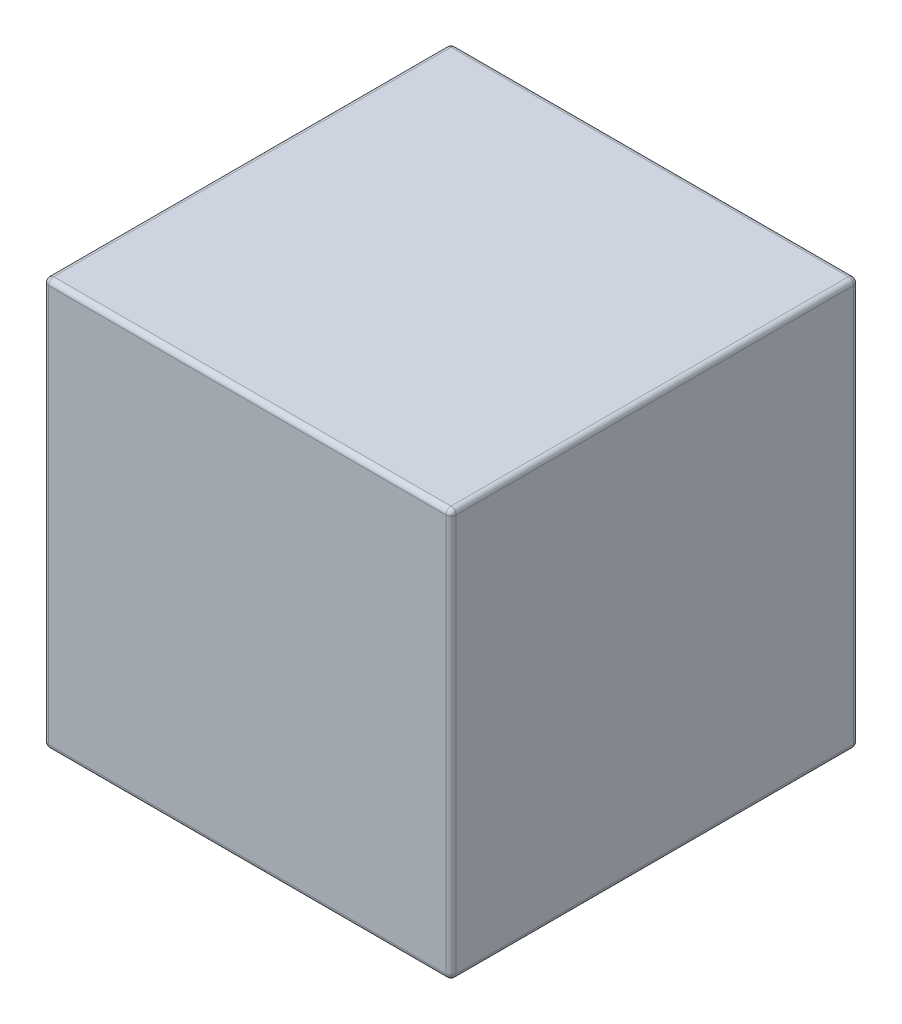
ISO-10303-21;
HEADER;
FILE_DESCRIPTION(('STEP AP214'),'2;1');
FILE_NAME('part.step','',(''),(''),'','','');
FILE_SCHEMA(('AUTOMOTIVE_DESIGN { 1 0 10303 214 1 1 1 1 }'));
ENDSEC;
DATA;
#1=APPLICATION_CONTEXT('core data for automotive mechanical design processes');
#2=APPLICATION_PROTOCOL_DEFINITION('international standard','automotive_design',2000,#1);
#3=PRODUCT_CONTEXT('',#1,'mechanical');
#4=PRODUCT('Part','Part','',(#3));
#5=PRODUCT_RELATED_PRODUCT_CATEGORY('part','',(#4));
#6=PRODUCT_DEFINITION_FORMATION('','',#4);
#7=PRODUCT_DEFINITION_CONTEXT('part definition',#1,'design');
#8=PRODUCT_DEFINITION('design','',#6,#7);
#9=PRODUCT_DEFINITION_SHAPE('','',#8);
#10=(LENGTH_UNIT() NAMED_UNIT(*) SI_UNIT(.MILLI.,.METRE.));
#11=(NAMED_UNIT(*) PLANE_ANGLE_UNIT() SI_UNIT($,.RADIAN.));
#12=(NAMED_UNIT(*) SI_UNIT($,.STERADIAN.) SOLID_ANGLE_UNIT());
#13=UNCERTAINTY_MEASURE_WITH_UNIT(LENGTH_MEASURE(1.E-05),#10,'distance_accuracy_value','');
#14=(GEOMETRIC_REPRESENTATION_CONTEXT(3) GLOBAL_UNCERTAINTY_ASSIGNED_CONTEXT((#13)) GLOBAL_UNIT_ASSIGNED_CONTEXT((#10,
#11,#12)) REPRESENTATION_CONTEXT('',''));
#15=CARTESIAN_POINT('',(0.,0.,0.));
#16=DIRECTION('',(0.,0.,1.));
#17=DIRECTION('',(1.,0.,0.));
#18=AXIS2_PLACEMENT_3D('',#15,#16,#17);
#19=CARTESIAN_POINT('',(25.4,50.8,25.4));
#20=DIRECTION('',(-1.,0.,0.));
#21=DIRECTION('',(0.,0.,1.));
#22=AXIS2_PLACEMENT_3D('',#19,#20,#21);
#23=PLANE('',#22);
#24=DIRECTION('',(0.,0.,-1.));
#25=VECTOR('',#24,1.);
#26=CARTESIAN_POINT('',(25.4,0.634999999999997,-25.4));
#27=LINE('',#26,#25);
#28=CARTESIAN_POINT('',(25.4,0.634999999999997,24.765));
#29=VERTEX_POINT('',#28);
#30=CARTESIAN_POINT('',(25.4,0.634999999999997,-24.765));
#31=VERTEX_POINT('',#30);
#32=EDGE_CURVE('E337',#29,#31,#27,.T.);
#33=ORIENTED_EDGE('',*,*,#32,.T.);
#34=DIRECTION('',(0.,-1.,0.));
#35=VECTOR('',#34,1.);
#36=CARTESIAN_POINT('',(25.4,50.8,-24.765));
#37=LINE('',#36,#35);
#38=CARTESIAN_POINT('',(25.4,50.165,-24.765));
#39=VERTEX_POINT('',#38);
#40=EDGE_CURVE('E257',#31,#39,#37,.F.);
#41=ORIENTED_EDGE('',*,*,#40,.T.);
#42=DIRECTION('',(0.,0.,-1.));
#43=VECTOR('',#42,1.);
#44=CARTESIAN_POINT('',(25.4,50.165,25.4));
#45=LINE('',#44,#43);
#46=CARTESIAN_POINT('',(25.4,50.165,24.765));
#47=VERTEX_POINT('',#46);
#48=EDGE_CURVE('E244',#39,#47,#45,.F.);
#49=ORIENTED_EDGE('',*,*,#48,.T.);
#50=DIRECTION('',(0.,-1.,0.));
#51=VECTOR('',#50,1.);
#52=CARTESIAN_POINT('',(25.4,50.8,24.765));
#53=LINE('',#52,#51);
#54=EDGE_CURVE('E332',#47,#29,#53,.T.);
#55=ORIENTED_EDGE('',*,*,#54,.T.);
#56=EDGE_LOOP('',(#33,#41,#49,#55));
#57=FACE_BOUND('',#56,.T.);
#58=ADVANCED_FACE('F46',(#57),#23,.F.);
#59=CARTESIAN_POINT('',(-25.4,50.8,-25.4));
#60=DIRECTION('',(0.,0.,1.));
#61=DIRECTION('',(1.,0.,0.));
#62=AXIS2_PLACEMENT_3D('',#59,#60,#61);
#63=PLANE('',#62);
#64=DIRECTION('',(-1.,0.,0.));
#65=VECTOR('',#64,1.);
#66=CARTESIAN_POINT('',(-25.4,0.634999999999997,-25.4));
#67=LINE('',#66,#65);
#68=CARTESIAN_POINT('',(24.765,0.634999999999997,-25.4));
#69=VERTEX_POINT('',#68);
#70=CARTESIAN_POINT('',(-24.765,0.634999999999997,-25.4));
#71=VERTEX_POINT('',#70);
#72=EDGE_CURVE('E310',#69,#71,#67,.T.);
#73=ORIENTED_EDGE('',*,*,#72,.T.);
#74=DIRECTION('',(0.,-1.,0.));
#75=VECTOR('',#74,1.);
#76=CARTESIAN_POINT('',(-24.765,50.8,-25.4));
#77=LINE('',#76,#75);
#78=CARTESIAN_POINT('',(-24.765,50.165,-25.4));
#79=VERTEX_POINT('',#78);
#80=EDGE_CURVE('E307',#71,#79,#77,.F.);
#81=ORIENTED_EDGE('',*,*,#80,.T.);
#82=DIRECTION('',(-1.,0.,0.));
#83=VECTOR('',#82,1.);
#84=CARTESIAN_POINT('',(-25.4,50.165,-25.4));
#85=LINE('',#84,#83);
#86=CARTESIAN_POINT('',(24.765,50.165,-25.4));
#87=VERTEX_POINT('',#86);
#88=EDGE_CURVE('E298',#79,#87,#85,.F.);
#89=ORIENTED_EDGE('',*,*,#88,.T.);
#90=DIRECTION('',(0.,-1.,0.));
#91=VECTOR('',#90,1.);
#92=CARTESIAN_POINT('',(24.765,50.8,-25.4));
#93=LINE('',#92,#91);
#94=EDGE_CURVE('E304',#87,#69,#93,.T.);
#95=ORIENTED_EDGE('',*,*,#94,.T.);
#96=EDGE_LOOP('',(#73,#81,#89,#95));
#97=FACE_BOUND('',#96,.T.);
#98=ADVANCED_FACE('F308',(#97),#63,.F.);
#99=CARTESIAN_POINT('',(-25.4,50.8,25.4));
#100=DIRECTION('',(1.,0.,0.));
#101=DIRECTION('',(0.,0.,-1.));
#102=AXIS2_PLACEMENT_3D('',#99,#100,#101);
#103=PLANE('',#102);
#104=DIRECTION('',(0.,0.,1.));
#105=VECTOR('',#104,1.);
#106=CARTESIAN_POINT('',(-25.4,50.165,25.4));
#107=LINE('',#106,#105);
#108=CARTESIAN_POINT('',(-25.4,50.165,24.765));
#109=VERTEX_POINT('',#108);
#110=CARTESIAN_POINT('',(-25.4,50.165,-24.765));
#111=VERTEX_POINT('',#110);
#112=EDGE_CURVE('E147',#109,#111,#107,.F.);
#113=ORIENTED_EDGE('',*,*,#112,.T.);
#114=DIRECTION('',(0.,-1.,0.));
#115=VECTOR('',#114,1.);
#116=CARTESIAN_POINT('',(-25.4,50.8,-24.765));
#117=LINE('',#116,#115);
#118=CARTESIAN_POINT('',(-25.4,0.634999999999997,-24.765));
#119=VERTEX_POINT('',#118);
#120=EDGE_CURVE('E142',#111,#119,#117,.T.);
#121=ORIENTED_EDGE('',*,*,#120,.T.);
#122=DIRECTION('',(0.,0.,1.));
#123=VECTOR('',#122,1.);
#124=CARTESIAN_POINT('',(-25.4,0.634999999999997,25.4));
#125=LINE('',#124,#123);
#126=CARTESIAN_POINT('',(-25.4,0.634999999999997,24.765));
#127=VERTEX_POINT('',#126);
#128=EDGE_CURVE('E136',#119,#127,#125,.T.);
#129=ORIENTED_EDGE('',*,*,#128,.T.);
#130=DIRECTION('',(0.,-1.,0.));
#131=VECTOR('',#130,1.);
#132=CARTESIAN_POINT('',(-25.4,50.8,24.765));
#133=LINE('',#132,#131);
#134=EDGE_CURVE('E139',#127,#109,#133,.F.);
#135=ORIENTED_EDGE('',*,*,#134,.T.);
#136=EDGE_LOOP('',(#113,#121,#129,#135));
#137=FACE_BOUND('',#136,.T.);
#138=ADVANCED_FACE('F138',(#137),#103,.F.);
#139=CARTESIAN_POINT('',(-25.4,50.8,25.4));
#140=DIRECTION('',(0.,0.,-1.));
#141=DIRECTION('',(-1.,0.,0.));
#142=AXIS2_PLACEMENT_3D('',#139,#140,#141);
#143=PLANE('',#142);
#144=DIRECTION('',(1.,0.,0.));
#145=VECTOR('',#144,1.);
#146=CARTESIAN_POINT('',(-25.4,50.165,25.4));
#147=LINE('',#146,#145);
#148=CARTESIAN_POINT('',(24.765,50.165,25.4));
#149=VERTEX_POINT('',#148);
#150=CARTESIAN_POINT('',(-24.765,50.165,25.4));
#151=VERTEX_POINT('',#150);
#152=EDGE_CURVE('E56',#149,#151,#147,.F.);
#153=ORIENTED_EDGE('',*,*,#152,.T.);
#154=DIRECTION('',(0.,-1.,0.));
#155=VECTOR('',#154,1.);
#156=CARTESIAN_POINT('',(-24.765,50.8,25.4));
#157=LINE('',#156,#155);
#158=CARTESIAN_POINT('',(-24.765,0.634999999999997,25.4));
#159=VERTEX_POINT('',#158);
#160=EDGE_CURVE('E11',#151,#159,#157,.T.);
#161=ORIENTED_EDGE('',*,*,#160,.T.);
#162=DIRECTION('',(1.,0.,0.));
#163=VECTOR('',#162,1.);
#164=CARTESIAN_POINT('',(25.4,0.634999999999997,25.4));
#165=LINE('',#164,#163);
#166=CARTESIAN_POINT('',(24.765,0.634999999999997,25.4));
#167=VERTEX_POINT('',#166);
#168=EDGE_CURVE('E264',#159,#167,#165,.T.);
#169=ORIENTED_EDGE('',*,*,#168,.T.);
#170=DIRECTION('',(0.,-1.,0.));
#171=VECTOR('',#170,1.);
#172=CARTESIAN_POINT('',(24.765,50.8,25.4));
#173=LINE('',#172,#171);
#174=EDGE_CURVE('E67',#167,#149,#173,.F.);
#175=ORIENTED_EDGE('',*,*,#174,.T.);
#176=EDGE_LOOP('',(#153,#161,#169,#175));
#177=FACE_BOUND('',#176,.T.);
#178=ADVANCED_FACE('F442',(#177),#143,.F.);
#179=CARTESIAN_POINT('',(0.,50.8,0.));
#180=DIRECTION('',(0.,-1.,0.));
#181=DIRECTION('',(0.,0.,-1.));
#182=AXIS2_PLACEMENT_3D('',#179,#180,#181);
#183=PLANE('',#182);
#184=DIRECTION('',(-1.,0.,0.));
#185=VECTOR('',#184,1.);
#186=CARTESIAN_POINT('',(0.,50.8,-24.765));
#187=LINE('',#186,#185);
#188=CARTESIAN_POINT('',(24.765,50.8,-24.765));
#189=VERTEX_POINT('',#188);
#190=CARTESIAN_POINT('',(-24.765,50.8,-24.765));
#191=VERTEX_POINT('',#190);
#192=EDGE_CURVE('E250',#189,#191,#187,.T.);
#193=ORIENTED_EDGE('',*,*,#192,.T.);
#194=DIRECTION('',(0.,0.,1.));
#195=VECTOR('',#194,1.);
#196=CARTESIAN_POINT('',(-24.765,50.8,0.));
#197=LINE('',#196,#195);
#198=CARTESIAN_POINT('',(-24.765,50.8,24.765));
#199=VERTEX_POINT('',#198);
#200=EDGE_CURVE('E255',#191,#199,#197,.T.);
#201=ORIENTED_EDGE('',*,*,#200,.T.);
#202=DIRECTION('',(1.,0.,0.));
#203=VECTOR('',#202,1.);
#204=CARTESIAN_POINT('',(0.,50.8,24.765));
#205=LINE('',#204,#203);
#206=CARTESIAN_POINT('',(24.765,50.8,24.765));
#207=VERTEX_POINT('',#206);
#208=EDGE_CURVE('E251',#199,#207,#205,.T.);
#209=ORIENTED_EDGE('',*,*,#208,.T.);
#210=DIRECTION('',(0.,0.,-1.));
#211=VECTOR('',#210,1.);
#212=CARTESIAN_POINT('',(24.765,50.8,0.));
#213=LINE('',#212,#211);
#214=EDGE_CURVE('E246',#207,#189,#213,.T.);
#215=ORIENTED_EDGE('',*,*,#214,.T.);
#216=EDGE_LOOP('',(#193,#201,#209,#215));
#217=FACE_BOUND('',#216,.T.);
#218=ADVANCED_FACE('F367',(#217),#183,.F.);
#219=CARTESIAN_POINT('',(0.,0.,0.));
#220=DIRECTION('',(0.,-1.,0.));
#221=DIRECTION('',(0.,0.,-1.));
#222=AXIS2_PLACEMENT_3D('',#219,#220,#221);
#223=PLANE('',#222);
#224=DIRECTION('',(0.,0.,1.));
#225=VECTOR('',#224,1.);
#226=CARTESIAN_POINT('',(-24.765,0.,-25.4));
#227=LINE('',#226,#225);
#228=CARTESIAN_POINT('',(-24.765,0.,24.765));
#229=VERTEX_POINT('',#228);
#230=CARTESIAN_POINT('',(-24.765,0.,-24.765));
#231=VERTEX_POINT('',#230);
#232=EDGE_CURVE('E170',#229,#231,#227,.F.);
#233=ORIENTED_EDGE('',*,*,#232,.T.);
#234=DIRECTION('',(-1.,0.,0.));
#235=VECTOR('',#234,1.);
#236=CARTESIAN_POINT('',(25.4,0.,-24.765));
#237=LINE('',#236,#235);
#238=CARTESIAN_POINT('',(24.765,0.,-24.765));
#239=VERTEX_POINT('',#238);
#240=EDGE_CURVE('E328',#231,#239,#237,.F.);
#241=ORIENTED_EDGE('',*,*,#240,.T.);
#242=DIRECTION('',(0.,0.,-1.));
#243=VECTOR('',#242,1.);
#244=CARTESIAN_POINT('',(24.765,0.,25.4));
#245=LINE('',#244,#243);
#246=CARTESIAN_POINT('',(24.765,0.,24.765));
#247=VERTEX_POINT('',#246);
#248=EDGE_CURVE('E319',#239,#247,#245,.F.);
#249=ORIENTED_EDGE('',*,*,#248,.T.);
#250=DIRECTION('',(1.,0.,0.));
#251=VECTOR('',#250,1.);
#252=CARTESIAN_POINT('',(-25.4,0.,24.765));
#253=LINE('',#252,#251);
#254=EDGE_CURVE('E315',#247,#229,#253,.F.);
#255=ORIENTED_EDGE('',*,*,#254,.T.);
#256=EDGE_LOOP('',(#233,#241,#249,#255));
#257=FACE_BOUND('',#256,.T.);
#258=ADVANCED_FACE('F433',(#257),#223,.T.);
#259=CARTESIAN_POINT('',(24.765,50.8,24.765));
#260=DIRECTION('',(0.,-1.,0.));
#261=DIRECTION('',(0.,0.,-1.));
#262=AXIS2_PLACEMENT_3D('',#259,#260,#261);
#263=CYLINDRICAL_SURFACE('',#262,0.635);
#264=CARTESIAN_POINT('',(24.765,50.165,24.765));
#265=DIRECTION('',(0.,1.,0.));
#266=DIRECTION('',(0.,0.,1.));
#267=AXIS2_PLACEMENT_3D('',#264,#265,#266);
#268=CIRCLE('',#267,0.635);
#269=EDGE_CURVE('E50',#149,#47,#268,.T.);
#270=ORIENTED_EDGE('',*,*,#269,.F.);
#271=ORIENTED_EDGE('',*,*,#174,.F.);
#272=CARTESIAN_POINT('',(24.765,0.634999999999997,24.765));
#273=DIRECTION('',(0.,-1.,0.));
#274=DIRECTION('',(0.,0.,-1.));
#275=AXIS2_PLACEMENT_3D('',#272,#273,#274);
#276=CIRCLE('',#275,0.635);
#277=EDGE_CURVE('E224',#29,#167,#276,.T.);
#278=ORIENTED_EDGE('',*,*,#277,.F.);
#279=ORIENTED_EDGE('',*,*,#54,.F.);
#280=EDGE_LOOP('',(#270,#271,#278,#279));
#281=FACE_BOUND('',#280,.T.);
#282=ADVANCED_FACE('F48',(#281),#263,.T.);
#283=CARTESIAN_POINT('',(24.765,50.165,24.765));
#284=DIRECTION('',(1.,0.,0.));
#285=DIRECTION('',(0.,0.,-1.));
#286=AXIS2_PLACEMENT_3D('',#283,#284,#285);
#287=SPHERICAL_SURFACE('',#286,0.635);
#288=CARTESIAN_POINT('',(24.765,50.165,24.765));
#289=DIRECTION('',(1.,0.,0.));
#290=DIRECTION('',(0.,0.,-1.));
#291=AXIS2_PLACEMENT_3D('',#288,#289,#290);
#292=CIRCLE('',#291,0.635);
#293=EDGE_CURVE('E217',#149,#207,#292,.F.);
#294=ORIENTED_EDGE('',*,*,#293,.F.);
#295=ORIENTED_EDGE('',*,*,#269,.T.);
#296=CARTESIAN_POINT('',(24.765,50.165,24.765));
#297=DIRECTION('',(0.,0.,1.));
#298=DIRECTION('',(1.,0.,0.));
#299=AXIS2_PLACEMENT_3D('',#296,#297,#298);
#300=CIRCLE('',#299,0.635);
#301=EDGE_CURVE('E221',#207,#47,#300,.F.);
#302=ORIENTED_EDGE('',*,*,#301,.F.);
#303=EDGE_LOOP('',(#294,#295,#302));
#304=FACE_BOUND('',#303,.T.);
#305=ADVANCED_FACE('F236',(#304),#287,.T.);
#306=CARTESIAN_POINT('',(24.765,0.635,24.765));
#307=DIRECTION('',(0.,0.,1.));
#308=DIRECTION('',(0.,-1.,0.));
#309=AXIS2_PLACEMENT_3D('',#306,#307,#308);
#310=SPHERICAL_SURFACE('',#309,0.635);
#311=CARTESIAN_POINT('',(24.765,0.635,24.765));
#312=DIRECTION('',(0.,0.,1.));
#313=DIRECTION('',(1.,0.,0.));
#314=AXIS2_PLACEMENT_3D('',#311,#312,#313);
#315=CIRCLE('',#314,0.635);
#316=EDGE_CURVE('E209',#29,#247,#315,.F.);
#317=ORIENTED_EDGE('',*,*,#316,.F.);
#318=ORIENTED_EDGE('',*,*,#277,.T.);
#319=CARTESIAN_POINT('',(24.765,0.634999999999997,24.765));
#320=DIRECTION('',(1.,0.,0.));
#321=DIRECTION('',(0.,0.,-1.));
#322=AXIS2_PLACEMENT_3D('',#319,#320,#321);
#323=CIRCLE('',#322,0.635);
#324=EDGE_CURVE('E213',#247,#167,#323,.F.);
#325=ORIENTED_EDGE('',*,*,#324,.F.);
#326=EDGE_LOOP('',(#317,#318,#325));
#327=FACE_BOUND('',#326,.T.);
#328=ADVANCED_FACE('F385',(#327),#310,.T.);
#329=CARTESIAN_POINT('',(24.765,50.165,0.));
#330=DIRECTION('',(0.,0.,-1.));
#331=DIRECTION('',(-1.,0.,0.));
#332=AXIS2_PLACEMENT_3D('',#329,#330,#331);
#333=CYLINDRICAL_SURFACE('',#332,0.635);
#334=ORIENTED_EDGE('',*,*,#301,.T.);
#335=ORIENTED_EDGE('',*,*,#48,.F.);
#336=CARTESIAN_POINT('',(24.765,50.165,-24.765));
#337=DIRECTION('',(0.,0.,-1.));
#338=DIRECTION('',(-1.,0.,0.));
#339=AXIS2_PLACEMENT_3D('',#336,#337,#338);
#340=CIRCLE('',#339,0.635);
#341=EDGE_CURVE('E202',#189,#39,#340,.T.);
#342=ORIENTED_EDGE('',*,*,#341,.F.);
#343=ORIENTED_EDGE('',*,*,#214,.F.);
#344=EDGE_LOOP('',(#334,#335,#342,#343));
#345=FACE_BOUND('',#344,.T.);
#346=ADVANCED_FACE('F242',(#345),#333,.T.);
#347=CARTESIAN_POINT('',(0.,50.165,24.765));
#348=DIRECTION('',(1.,0.,0.));
#349=DIRECTION('',(0.,0.,-1.));
#350=AXIS2_PLACEMENT_3D('',#347,#348,#349);
#351=CYLINDRICAL_SURFACE('',#350,0.635);
#352=ORIENTED_EDGE('',*,*,#293,.T.);
#353=ORIENTED_EDGE('',*,*,#208,.F.);
#354=CARTESIAN_POINT('',(-24.765,50.165,24.765));
#355=DIRECTION('',(-1.,0.,0.));
#356=DIRECTION('',(0.,0.,1.));
#357=AXIS2_PLACEMENT_3D('',#354,#355,#356);
#358=CIRCLE('',#357,0.635);
#359=EDGE_CURVE('E198',#151,#199,#358,.T.);
#360=ORIENTED_EDGE('',*,*,#359,.F.);
#361=ORIENTED_EDGE('',*,*,#152,.F.);
#362=EDGE_LOOP('',(#352,#353,#360,#361));
#363=FACE_BOUND('',#362,.T.);
#364=ADVANCED_FACE('F376',(#363),#351,.T.);
#365=CARTESIAN_POINT('',(-24.765,50.8,24.765));
#366=DIRECTION('',(0.,-1.,0.));
#367=DIRECTION('',(0.,0.,-1.));
#368=AXIS2_PLACEMENT_3D('',#365,#366,#367);
#369=CYLINDRICAL_SURFACE('',#368,0.635);
#370=CARTESIAN_POINT('',(-24.765,0.634999999999997,24.765));
#371=DIRECTION('',(0.,-1.,0.));
#372=DIRECTION('',(0.,0.,-1.));
#373=AXIS2_PLACEMENT_3D('',#370,#371,#372);
#374=CIRCLE('',#373,0.635);
#375=EDGE_CURVE('E153',#159,#127,#374,.T.);
#376=ORIENTED_EDGE('',*,*,#375,.F.);
#377=ORIENTED_EDGE('',*,*,#160,.F.);
#378=CARTESIAN_POINT('',(-24.765,50.165,24.765));
#379=DIRECTION('',(0.,1.,0.));
#380=DIRECTION('',(0.,0.,1.));
#381=AXIS2_PLACEMENT_3D('',#378,#379,#380);
#382=CIRCLE('',#381,0.635);
#383=EDGE_CURVE('E156',#109,#151,#382,.T.);
#384=ORIENTED_EDGE('',*,*,#383,.F.);
#385=ORIENTED_EDGE('',*,*,#134,.F.);
#386=EDGE_LOOP('',(#376,#377,#384,#385));
#387=FACE_BOUND('',#386,.T.);
#388=ADVANCED_FACE('F152',(#387),#369,.T.);
#389=CARTESIAN_POINT('',(-25.4,0.634999999999997,24.765));
#390=DIRECTION('',(-1.,0.,0.));
#391=DIRECTION('',(0.,0.,1.));
#392=AXIS2_PLACEMENT_3D('',#389,#390,#391);
#393=CYLINDRICAL_SURFACE('',#392,0.635);
#394=ORIENTED_EDGE('',*,*,#324,.T.);
#395=ORIENTED_EDGE('',*,*,#168,.F.);
#396=CARTESIAN_POINT('',(-24.765,0.635,24.765));
#397=DIRECTION('',(-1.,0.,0.));
#398=DIRECTION('',(0.,0.,1.));
#399=AXIS2_PLACEMENT_3D('',#396,#397,#398);
#400=CIRCLE('',#399,0.635);
#401=EDGE_CURVE('E166',#229,#159,#400,.T.);
#402=ORIENTED_EDGE('',*,*,#401,.F.);
#403=ORIENTED_EDGE('',*,*,#254,.F.);
#404=EDGE_LOOP('',(#394,#395,#402,#403));
#405=FACE_BOUND('',#404,.T.);
#406=ADVANCED_FACE('F383',(#405),#393,.T.);
#407=CARTESIAN_POINT('',(24.765,0.634999999999997,25.4));
#408=DIRECTION('',(0.,0.,1.));
#409=DIRECTION('',(1.,0.,0.));
#410=AXIS2_PLACEMENT_3D('',#407,#408,#409);
#411=CYLINDRICAL_SURFACE('',#410,0.635);
#412=ORIENTED_EDGE('',*,*,#316,.T.);
#413=ORIENTED_EDGE('',*,*,#248,.F.);
#414=CARTESIAN_POINT('',(24.765,0.634999999999997,-24.765));
#415=DIRECTION('',(0.,0.,-1.));
#416=DIRECTION('',(-1.,0.,0.));
#417=AXIS2_PLACEMENT_3D('',#414,#415,#416);
#418=CIRCLE('',#417,0.635);
#419=EDGE_CURVE('E190',#31,#239,#418,.T.);
#420=ORIENTED_EDGE('',*,*,#419,.F.);
#421=ORIENTED_EDGE('',*,*,#32,.F.);
#422=EDGE_LOOP('',(#412,#413,#420,#421));
#423=FACE_BOUND('',#422,.T.);
#424=ADVANCED_FACE('F351',(#423),#411,.T.);
#425=CARTESIAN_POINT('',(24.765,50.8,-24.765));
#426=DIRECTION('',(0.,-1.,0.));
#427=DIRECTION('',(0.,0.,-1.));
#428=AXIS2_PLACEMENT_3D('',#425,#426,#427);
#429=CYLINDRICAL_SURFACE('',#428,0.635);
#430=CARTESIAN_POINT('',(24.765,50.165,-24.765));
#431=DIRECTION('',(0.,1.,0.));
#432=DIRECTION('',(0.,0.,1.));
#433=AXIS2_PLACEMENT_3D('',#430,#431,#432);
#434=CIRCLE('',#433,0.635);
#435=EDGE_CURVE('E205',#39,#87,#434,.T.);
#436=ORIENTED_EDGE('',*,*,#435,.F.);
#437=ORIENTED_EDGE('',*,*,#40,.F.);
#438=CARTESIAN_POINT('',(24.765,0.634999999999997,-24.765));
#439=DIRECTION('',(0.,-1.,0.));
#440=DIRECTION('',(0.,0.,-1.));
#441=AXIS2_PLACEMENT_3D('',#438,#439,#440);
#442=CIRCLE('',#441,0.635);
#443=EDGE_CURVE('E186',#69,#31,#442,.T.);
#444=ORIENTED_EDGE('',*,*,#443,.F.);
#445=ORIENTED_EDGE('',*,*,#94,.F.);
#446=EDGE_LOOP('',(#436,#437,#444,#445));
#447=FACE_BOUND('',#446,.T.);
#448=ADVANCED_FACE('F347',(#447),#429,.T.);
#449=CARTESIAN_POINT('',(24.765,50.165,-24.765));
#450=DIRECTION('',(1.,0.,0.));
#451=DIRECTION('',(0.,0.,-1.));
#452=AXIS2_PLACEMENT_3D('',#449,#450,#451);
#453=SPHERICAL_SURFACE('',#452,0.635);
#454=ORIENTED_EDGE('',*,*,#341,.T.);
#455=ORIENTED_EDGE('',*,*,#435,.T.);
#456=CARTESIAN_POINT('',(24.765,50.165,-24.765));
#457=DIRECTION('',(1.,0.,0.));
#458=DIRECTION('',(0.,1.,0.));
#459=AXIS2_PLACEMENT_3D('',#456,#457,#458);
#460=CIRCLE('',#459,0.635);
#461=EDGE_CURVE('E177',#189,#87,#460,.F.);
#462=ORIENTED_EDGE('',*,*,#461,.F.);
#463=EDGE_LOOP('',(#454,#455,#462));
#464=FACE_BOUND('',#463,.T.);
#465=ADVANCED_FACE('F365',(#464),#453,.T.);
#466=CARTESIAN_POINT('',(-24.765,50.165,24.765));
#467=DIRECTION('',(0.,0.,1.));
#468=DIRECTION('',(1.,0.,0.));
#469=AXIS2_PLACEMENT_3D('',#466,#467,#468);
#470=SPHERICAL_SURFACE('',#469,0.635);
#471=ORIENTED_EDGE('',*,*,#383,.T.);
#472=ORIENTED_EDGE('',*,*,#359,.T.);
#473=CARTESIAN_POINT('',(-24.765,50.165,24.765));
#474=DIRECTION('',(0.,0.,1.));
#475=DIRECTION('',(1.,0.,0.));
#476=AXIS2_PLACEMENT_3D('',#473,#474,#475);
#477=CIRCLE('',#476,0.635);
#478=EDGE_CURVE('E172',#109,#199,#477,.F.);
#479=ORIENTED_EDGE('',*,*,#478,.F.);
#480=EDGE_LOOP('',(#471,#472,#479));
#481=FACE_BOUND('',#480,.T.);
#482=ADVANCED_FACE('F374',(#481),#470,.T.);
#483=CARTESIAN_POINT('',(-24.765,0.635,24.765));
#484=DIRECTION('',(0.,0.,1.));
#485=DIRECTION('',(0.,-1.,0.));
#486=AXIS2_PLACEMENT_3D('',#483,#484,#485);
#487=SPHERICAL_SURFACE('',#486,0.635);
#488=ORIENTED_EDGE('',*,*,#401,.T.);
#489=ORIENTED_EDGE('',*,*,#375,.T.);
#490=CARTESIAN_POINT('',(-24.765,0.634999999999997,24.765));
#491=DIRECTION('',(0.,0.,1.));
#492=DIRECTION('',(1.,0.,0.));
#493=AXIS2_PLACEMENT_3D('',#490,#491,#492);
#494=CIRCLE('',#493,0.635);
#495=EDGE_CURVE('E163',#229,#127,#494,.F.);
#496=ORIENTED_EDGE('',*,*,#495,.F.);
#497=EDGE_LOOP('',(#488,#489,#496));
#498=FACE_BOUND('',#497,.T.);
#499=ADVANCED_FACE('F162',(#498),#487,.T.);
#500=CARTESIAN_POINT('',(24.765,0.635,-24.765));
#501=DIRECTION('',(1.,0.,0.));
#502=DIRECTION('',(0.,1.,0.));
#503=AXIS2_PLACEMENT_3D('',#500,#501,#502);
#504=SPHERICAL_SURFACE('',#503,0.635);
#505=ORIENTED_EDGE('',*,*,#443,.T.);
#506=ORIENTED_EDGE('',*,*,#419,.T.);
#507=CARTESIAN_POINT('',(24.765,0.635,-24.765));
#508=DIRECTION('',(1.,0.,0.));
#509=DIRECTION('',(0.,0.,-1.));
#510=AXIS2_PLACEMENT_3D('',#507,#508,#509);
#511=CIRCLE('',#510,0.635);
#512=EDGE_CURVE('E173',#69,#239,#511,.F.);
#513=ORIENTED_EDGE('',*,*,#512,.F.);
#514=EDGE_LOOP('',(#505,#506,#513));
#515=FACE_BOUND('',#514,.T.);
#516=ADVANCED_FACE('F353',(#515),#504,.T.);
#517=CARTESIAN_POINT('',(0.,50.165,-24.765));
#518=DIRECTION('',(-1.,0.,0.));
#519=DIRECTION('',(0.,0.,1.));
#520=AXIS2_PLACEMENT_3D('',#517,#518,#519);
#521=CYLINDRICAL_SURFACE('',#520,0.635);
#522=ORIENTED_EDGE('',*,*,#461,.T.);
#523=ORIENTED_EDGE('',*,*,#88,.F.);
#524=CARTESIAN_POINT('',(-24.765,50.165,-24.765));
#525=DIRECTION('',(-1.,0.,0.));
#526=DIRECTION('',(0.,0.,1.));
#527=AXIS2_PLACEMENT_3D('',#524,#525,#526);
#528=CIRCLE('',#527,0.635);
#529=EDGE_CURVE('E179',#191,#79,#528,.T.);
#530=ORIENTED_EDGE('',*,*,#529,.F.);
#531=ORIENTED_EDGE('',*,*,#192,.F.);
#532=EDGE_LOOP('',(#522,#523,#530,#531));
#533=FACE_BOUND('',#532,.T.);
#534=ADVANCED_FACE('F300',(#533),#521,.T.);
#535=CARTESIAN_POINT('',(-24.765,50.165,0.));
#536=DIRECTION('',(0.,0.,1.));
#537=DIRECTION('',(1.,0.,0.));
#538=AXIS2_PLACEMENT_3D('',#535,#536,#537);
#539=CYLINDRICAL_SURFACE('',#538,0.635);
#540=ORIENTED_EDGE('',*,*,#478,.T.);
#541=ORIENTED_EDGE('',*,*,#200,.F.);
#542=CARTESIAN_POINT('',(-24.765,50.165,-24.765));
#543=DIRECTION('',(0.,0.,-1.));
#544=DIRECTION('',(0.,1.,0.));
#545=AXIS2_PLACEMENT_3D('',#542,#543,#544);
#546=CIRCLE('',#545,0.635);
#547=EDGE_CURVE('E285',#111,#191,#546,.T.);
#548=ORIENTED_EDGE('',*,*,#547,.F.);
#549=ORIENTED_EDGE('',*,*,#112,.F.);
#550=EDGE_LOOP('',(#540,#541,#548,#549));
#551=FACE_BOUND('',#550,.T.);
#552=ADVANCED_FACE('F369',(#551),#539,.T.);
#553=CARTESIAN_POINT('',(-24.765,0.634999999999997,25.4));
#554=DIRECTION('',(0.,0.,-1.));
#555=DIRECTION('',(-1.,0.,0.));
#556=AXIS2_PLACEMENT_3D('',#553,#554,#555);
#557=CYLINDRICAL_SURFACE('',#556,0.635);
#558=ORIENTED_EDGE('',*,*,#495,.T.);
#559=ORIENTED_EDGE('',*,*,#128,.F.);
#560=CARTESIAN_POINT('',(-24.765,0.635,-24.765));
#561=DIRECTION('',(0.,0.,-1.));
#562=DIRECTION('',(-1.,0.,0.));
#563=AXIS2_PLACEMENT_3D('',#560,#561,#562);
#564=CIRCLE('',#563,0.635);
#565=EDGE_CURVE('E281',#231,#119,#564,.T.);
#566=ORIENTED_EDGE('',*,*,#565,.F.);
#567=ORIENTED_EDGE('',*,*,#232,.F.);
#568=EDGE_LOOP('',(#558,#559,#566,#567));
#569=FACE_BOUND('',#568,.T.);
#570=ADVANCED_FACE('F169',(#569),#557,.T.);
#571=CARTESIAN_POINT('',(-25.4,0.634999999999997,-24.765));
#572=DIRECTION('',(1.,0.,0.));
#573=DIRECTION('',(0.,0.,-1.));
#574=AXIS2_PLACEMENT_3D('',#571,#572,#573);
#575=CYLINDRICAL_SURFACE('',#574,0.635);
#576=ORIENTED_EDGE('',*,*,#512,.T.);
#577=ORIENTED_EDGE('',*,*,#240,.F.);
#578=CARTESIAN_POINT('',(-24.765,0.634999999999997,-24.765));
#579=DIRECTION('',(-1.,0.,0.));
#580=DIRECTION('',(0.,0.,1.));
#581=AXIS2_PLACEMENT_3D('',#578,#579,#580);
#582=CIRCLE('',#581,0.635);
#583=EDGE_CURVE('E277',#71,#231,#582,.T.);
#584=ORIENTED_EDGE('',*,*,#583,.F.);
#585=ORIENTED_EDGE('',*,*,#72,.F.);
#586=EDGE_LOOP('',(#576,#577,#584,#585));
#587=FACE_BOUND('',#586,.T.);
#588=ADVANCED_FACE('F356',(#587),#575,.T.);
#589=CARTESIAN_POINT('',(-24.765,50.165,-24.765));
#590=DIRECTION('',(0.,1.,0.));
#591=DIRECTION('',(0.,0.,1.));
#592=AXIS2_PLACEMENT_3D('',#589,#590,#591);
#593=SPHERICAL_SURFACE('',#592,0.635);
#594=ORIENTED_EDGE('',*,*,#547,.T.);
#595=ORIENTED_EDGE('',*,*,#529,.T.);
#596=CARTESIAN_POINT('',(-24.765,50.165,-24.765));
#597=DIRECTION('',(0.,1.,0.));
#598=DIRECTION('',(0.,0.,1.));
#599=AXIS2_PLACEMENT_3D('',#596,#597,#598);
#600=CIRCLE('',#599,0.635);
#601=EDGE_CURVE('E274',#111,#79,#600,.F.);
#602=ORIENTED_EDGE('',*,*,#601,.F.);
#603=EDGE_LOOP('',(#594,#595,#602));
#604=FACE_BOUND('',#603,.T.);
#605=ADVANCED_FACE('F294',(#604),#593,.T.);
#606=CARTESIAN_POINT('',(-24.765,0.635,-24.765));
#607=DIRECTION('',(0.,-1.,0.));
#608=DIRECTION('',(0.,0.,-1.));
#609=AXIS2_PLACEMENT_3D('',#606,#607,#608);
#610=SPHERICAL_SURFACE('',#609,0.635);
#611=ORIENTED_EDGE('',*,*,#583,.T.);
#612=ORIENTED_EDGE('',*,*,#565,.T.);
#613=CARTESIAN_POINT('',(-24.765,0.634999999999997,-24.765));
#614=DIRECTION('',(0.,-1.,0.));
#615=DIRECTION('',(0.,0.,-1.));
#616=AXIS2_PLACEMENT_3D('',#613,#614,#615);
#617=CIRCLE('',#616,0.635);
#618=EDGE_CURVE('E271',#71,#119,#617,.F.);
#619=ORIENTED_EDGE('',*,*,#618,.F.);
#620=EDGE_LOOP('',(#611,#612,#619));
#621=FACE_BOUND('',#620,.T.);
#622=ADVANCED_FACE('F358',(#621),#610,.T.);
#623=CARTESIAN_POINT('',(-24.765,50.8,-24.765));
#624=DIRECTION('',(0.,-1.,0.));
#625=DIRECTION('',(0.,0.,-1.));
#626=AXIS2_PLACEMENT_3D('',#623,#624,#625);
#627=CYLINDRICAL_SURFACE('',#626,0.635);
#628=ORIENTED_EDGE('',*,*,#601,.T.);
#629=ORIENTED_EDGE('',*,*,#80,.F.);
#630=ORIENTED_EDGE('',*,*,#618,.T.);
#631=ORIENTED_EDGE('',*,*,#120,.F.);
#632=EDGE_LOOP('',(#628,#629,#630,#631));
#633=FACE_BOUND('',#632,.T.);
#634=ADVANCED_FACE('F359',(#633),#627,.T.);
#635=CLOSED_SHELL('',(#58,#98,#138,#178,#218,#258,#282,#305,#328,#346,#364,#388,#406,#424,#448,
#465,#482,#499,#516,#534,#552,#570,#588,#605,#622,#634));
#636=MANIFOLD_SOLID_BREP('B2',#635);
#637=ADVANCED_BREP_SHAPE_REPRESENTATION('',(#18,#636),#14);
#638=SHAPE_DEFINITION_REPRESENTATION(#9,#637);
ENDSEC;
END-ISO-10303-21;
